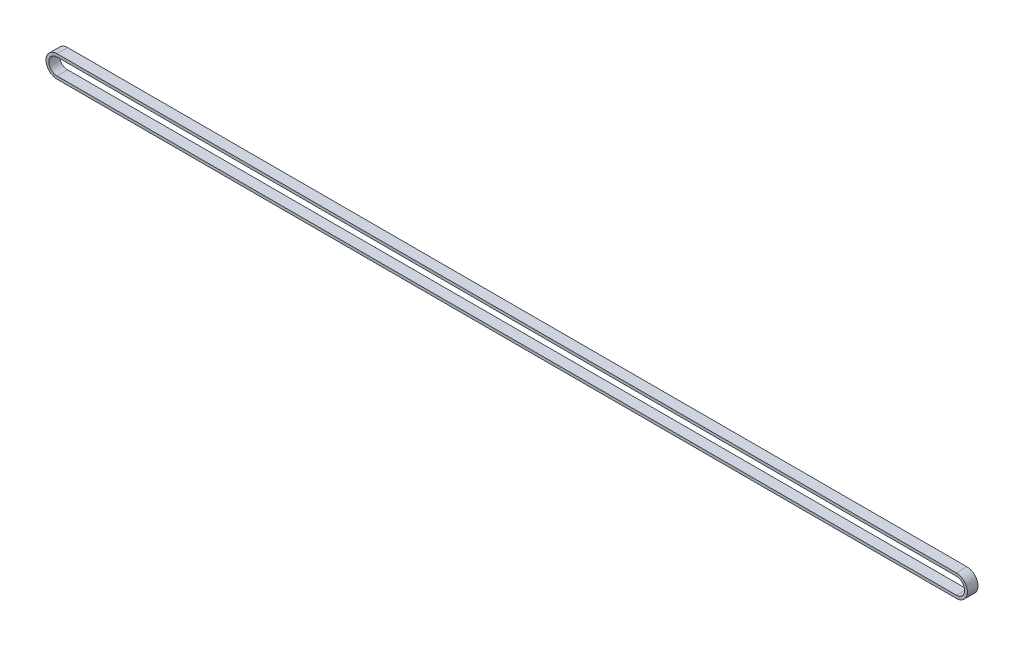
ISO-10303-21;
HEADER;
FILE_DESCRIPTION(('STEP AP214'),'2;1');
FILE_NAME('part.step','',(''),(''),'','','');
FILE_SCHEMA(('AUTOMOTIVE_DESIGN { 1 0 10303 214 1 1 1 1 }'));
ENDSEC;
DATA;
#1=APPLICATION_CONTEXT('core data for automotive mechanical design processes');
#2=APPLICATION_PROTOCOL_DEFINITION('international standard','automotive_design',2000,#1);
#3=PRODUCT_CONTEXT('',#1,'mechanical');
#4=PRODUCT('Part','Part','',(#3));
#5=PRODUCT_RELATED_PRODUCT_CATEGORY('part','',(#4));
#6=PRODUCT_DEFINITION_FORMATION('','',#4);
#7=PRODUCT_DEFINITION_CONTEXT('part definition',#1,'design');
#8=PRODUCT_DEFINITION('design','',#6,#7);
#9=PRODUCT_DEFINITION_SHAPE('','',#8);
#10=(LENGTH_UNIT() NAMED_UNIT(*) SI_UNIT(.MILLI.,.METRE.));
#11=(NAMED_UNIT(*) PLANE_ANGLE_UNIT() SI_UNIT($,.RADIAN.));
#12=(NAMED_UNIT(*) SI_UNIT($,.STERADIAN.) SOLID_ANGLE_UNIT());
#13=UNCERTAINTY_MEASURE_WITH_UNIT(LENGTH_MEASURE(1.E-05),#10,'distance_accuracy_value','');
#14=(GEOMETRIC_REPRESENTATION_CONTEXT(3) GLOBAL_UNCERTAINTY_ASSIGNED_CONTEXT((#13)) GLOBAL_UNIT_ASSIGNED_CONTEXT((#10,
#11,#12)) REPRESENTATION_CONTEXT('',''));
#15=CARTESIAN_POINT('',(0.,0.,0.));
#16=DIRECTION('',(0.,0.,1.));
#17=DIRECTION('',(1.,0.,0.));
#18=AXIS2_PLACEMENT_3D('',#15,#16,#17);
#19=CARTESIAN_POINT('',(528.475,0.,0.));
#20=DIRECTION('',(0.,0.,1.));
#21=DIRECTION('',(1.,0.,0.));
#22=AXIS2_PLACEMENT_3D('',#19,#20,#21);
#23=CYLINDRICAL_SURFACE('',#22,6.5);
#24=CARTESIAN_POINT('',(528.475,0.,6.25));
#25=DIRECTION('',(0.,0.,1.));
#26=DIRECTION('',(1.,0.,0.));
#27=AXIS2_PLACEMENT_3D('',#24,#25,#26);
#28=CIRCLE('',#27,6.5);
#29=CARTESIAN_POINT('',(528.475,-6.5,6.25));
#30=VERTEX_POINT('',#29);
#31=CARTESIAN_POINT('',(528.475,6.5,6.25));
#32=VERTEX_POINT('',#31);
#33=EDGE_CURVE('E131',#30,#32,#28,.T.);
#34=ORIENTED_EDGE('',*,*,#33,.F.);
#35=DIRECTION('',(0.,0.,1.));
#36=VECTOR('',#35,1.);
#37=CARTESIAN_POINT('',(528.475,-6.5,0.));
#38=LINE('',#37,#36);
#39=CARTESIAN_POINT('',(528.475,-6.5,0.));
#40=VERTEX_POINT('',#39);
#41=EDGE_CURVE('E11',#40,#30,#38,.T.);
#42=ORIENTED_EDGE('',*,*,#41,.F.);
#43=CARTESIAN_POINT('',(528.475,0.,0.));
#44=DIRECTION('',(0.,0.,1.));
#45=DIRECTION('',(1.,0.,0.));
#46=AXIS2_PLACEMENT_3D('',#43,#44,#45);
#47=CIRCLE('',#46,6.5);
#48=CARTESIAN_POINT('',(528.475,6.5,0.));
#49=VERTEX_POINT('',#48);
#50=EDGE_CURVE('E135',#40,#49,#47,.T.);
#51=ORIENTED_EDGE('',*,*,#50,.T.);
#52=DIRECTION('',(0.,0.,1.));
#53=VECTOR('',#52,1.);
#54=CARTESIAN_POINT('',(528.475,6.5,0.));
#55=LINE('',#54,#53);
#56=EDGE_CURVE('E36',#49,#32,#55,.T.);
#57=ORIENTED_EDGE('',*,*,#56,.T.);
#58=EDGE_LOOP('',(#34,#42,#51,#57));
#59=FACE_BOUND('',#58,.T.);
#60=ADVANCED_FACE('F33',(#59),#23,.T.);
#61=CARTESIAN_POINT('',(0.,-6.5,0.));
#62=DIRECTION('',(0.,-1.,0.));
#63=DIRECTION('',(0.,0.,-1.));
#64=AXIS2_PLACEMENT_3D('',#61,#62,#63);
#65=PLANE('',#64);
#66=DIRECTION('',(1.,0.,0.));
#67=VECTOR('',#66,1.);
#68=CARTESIAN_POINT('',(0.,-6.5,6.25));
#69=LINE('',#68,#67);
#70=CARTESIAN_POINT('',(0.,-6.5,6.25));
#71=VERTEX_POINT('',#70);
#72=EDGE_CURVE('E139',#71,#30,#69,.T.);
#73=ORIENTED_EDGE('',*,*,#72,.F.);
#74=DIRECTION('',(0.,0.,1.));
#75=VECTOR('',#74,1.);
#76=CARTESIAN_POINT('',(0.,-6.5,0.));
#77=LINE('',#76,#75);
#78=CARTESIAN_POINT('',(0.,-6.5,0.));
#79=VERTEX_POINT('',#78);
#80=EDGE_CURVE('E41',#79,#71,#77,.T.);
#81=ORIENTED_EDGE('',*,*,#80,.F.);
#82=DIRECTION('',(1.,0.,0.));
#83=VECTOR('',#82,1.);
#84=CARTESIAN_POINT('',(0.,-6.5,0.));
#85=LINE('',#84,#83);
#86=EDGE_CURVE('E145',#79,#40,#85,.T.);
#87=ORIENTED_EDGE('',*,*,#86,.T.);
#88=ORIENTED_EDGE('',*,*,#41,.T.);
#89=EDGE_LOOP('',(#73,#81,#87,#88));
#90=FACE_BOUND('',#89,.T.);
#91=ADVANCED_FACE('F171',(#90),#65,.T.);
#92=CARTESIAN_POINT('',(0.,0.,0.));
#93=DIRECTION('',(0.,0.,1.));
#94=DIRECTION('',(1.,0.,0.));
#95=AXIS2_PLACEMENT_3D('',#92,#93,#94);
#96=CYLINDRICAL_SURFACE('',#95,6.5);
#97=CARTESIAN_POINT('',(0.,0.,6.25));
#98=DIRECTION('',(0.,0.,1.));
#99=DIRECTION('',(1.,0.,0.));
#100=AXIS2_PLACEMENT_3D('',#97,#98,#99);
#101=CIRCLE('',#100,6.5);
#102=CARTESIAN_POINT('',(0.,6.5,6.25));
#103=VERTEX_POINT('',#102);
#104=EDGE_CURVE('E153',#103,#71,#101,.T.);
#105=ORIENTED_EDGE('',*,*,#104,.F.);
#106=DIRECTION('',(0.,0.,1.));
#107=VECTOR('',#106,1.);
#108=CARTESIAN_POINT('',(0.,6.5,0.));
#109=LINE('',#108,#107);
#110=CARTESIAN_POINT('',(0.,6.5,0.));
#111=VERTEX_POINT('',#110);
#112=EDGE_CURVE('E158',#111,#103,#109,.T.);
#113=ORIENTED_EDGE('',*,*,#112,.F.);
#114=CARTESIAN_POINT('',(0.,0.,0.));
#115=DIRECTION('',(0.,0.,1.));
#116=DIRECTION('',(1.,0.,0.));
#117=AXIS2_PLACEMENT_3D('',#114,#115,#116);
#118=CIRCLE('',#117,6.5);
#119=EDGE_CURVE('E142',#111,#79,#118,.T.);
#120=ORIENTED_EDGE('',*,*,#119,.T.);
#121=ORIENTED_EDGE('',*,*,#80,.T.);
#122=EDGE_LOOP('',(#105,#113,#120,#121));
#123=FACE_BOUND('',#122,.T.);
#124=ADVANCED_FACE('F175',(#123),#96,.T.);
#125=CARTESIAN_POINT('',(528.475,6.5,0.));
#126=DIRECTION('',(0.,1.,0.));
#127=DIRECTION('',(0.,0.,1.));
#128=AXIS2_PLACEMENT_3D('',#125,#126,#127);
#129=PLANE('',#128);
#130=DIRECTION('',(-1.,0.,0.));
#131=VECTOR('',#130,1.);
#132=CARTESIAN_POINT('',(528.475,6.5,6.25));
#133=LINE('',#132,#131);
#134=EDGE_CURVE('E150',#32,#103,#133,.T.);
#135=ORIENTED_EDGE('',*,*,#134,.F.);
#136=ORIENTED_EDGE('',*,*,#56,.F.);
#137=DIRECTION('',(-1.,0.,0.));
#138=VECTOR('',#137,1.);
#139=CARTESIAN_POINT('',(528.475,6.5,0.));
#140=LINE('',#139,#138);
#141=EDGE_CURVE('E138',#49,#111,#140,.T.);
#142=ORIENTED_EDGE('',*,*,#141,.T.);
#143=ORIENTED_EDGE('',*,*,#112,.T.);
#144=EDGE_LOOP('',(#135,#136,#142,#143));
#145=FACE_BOUND('',#144,.T.);
#146=ADVANCED_FACE('F166',(#145),#129,.T.);
#147=CARTESIAN_POINT('',(528.475,0.,0.));
#148=DIRECTION('',(0.,0.,1.));
#149=DIRECTION('',(1.,0.,0.));
#150=AXIS2_PLACEMENT_3D('',#147,#148,#149);
#151=PLANE('',#150);
#152=DIRECTION('',(-1.,0.,0.));
#153=VECTOR('',#152,1.);
#154=CARTESIAN_POINT('',(0.,4.848,0.));
#155=LINE('',#154,#153);
#156=CARTESIAN_POINT('',(528.475,4.84800000000001,0.));
#157=VERTEX_POINT('',#156);
#158=CARTESIAN_POINT('',(0.,4.848,0.));
#159=VERTEX_POINT('',#158);
#160=EDGE_CURVE('E106',#157,#159,#155,.T.);
#161=ORIENTED_EDGE('',*,*,#160,.T.);
#162=CARTESIAN_POINT('',(0.,0.,0.));
#163=DIRECTION('',(0.,0.,1.));
#164=DIRECTION('',(-1.,0.,0.));
#165=AXIS2_PLACEMENT_3D('',#162,#163,#164);
#166=CIRCLE('',#165,4.848);
#167=CARTESIAN_POINT('',(0.,-4.848,0.));
#168=VERTEX_POINT('',#167);
#169=EDGE_CURVE('E100',#159,#168,#166,.T.);
#170=ORIENTED_EDGE('',*,*,#169,.T.);
#171=DIRECTION('',(1.,0.,0.));
#172=VECTOR('',#171,1.);
#173=CARTESIAN_POINT('',(528.475,-4.848,0.));
#174=LINE('',#173,#172);
#175=CARTESIAN_POINT('',(528.475,-4.848,0.));
#176=VERTEX_POINT('',#175);
#177=EDGE_CURVE('E109',#168,#176,#174,.T.);
#178=ORIENTED_EDGE('',*,*,#177,.T.);
#179=CARTESIAN_POINT('',(528.475,0.,0.));
#180=DIRECTION('',(0.,0.,1.));
#181=DIRECTION('',(-1.,0.,0.));
#182=AXIS2_PLACEMENT_3D('',#179,#180,#181);
#183=CIRCLE('',#182,4.848);
#184=EDGE_CURVE('E49',#176,#157,#183,.T.);
#185=ORIENTED_EDGE('',*,*,#184,.T.);
#186=EDGE_LOOP('',(#161,#170,#178,#185));
#187=FACE_BOUND('',#186,.T.);
#188=ORIENTED_EDGE('',*,*,#50,.F.);
#189=ORIENTED_EDGE('',*,*,#86,.F.);
#190=ORIENTED_EDGE('',*,*,#119,.F.);
#191=ORIENTED_EDGE('',*,*,#141,.F.);
#192=EDGE_LOOP('',(#188,#189,#190,#191));
#193=FACE_BOUND('',#192,.T.);
#194=ADVANCED_FACE('F113',(#187,#193),#151,.F.);
#195=CARTESIAN_POINT('',(528.475,0.,6.25));
#196=DIRECTION('',(0.,0.,1.));
#197=DIRECTION('',(1.,0.,0.));
#198=AXIS2_PLACEMENT_3D('',#195,#196,#197);
#199=PLANE('',#198);
#200=CARTESIAN_POINT('',(0.,0.,6.25));
#201=DIRECTION('',(0.,0.,1.));
#202=DIRECTION('',(-1.,0.,0.));
#203=AXIS2_PLACEMENT_3D('',#200,#201,#202);
#204=CIRCLE('',#203,4.848);
#205=CARTESIAN_POINT('',(0.,4.848,6.25));
#206=VERTEX_POINT('',#205);
#207=CARTESIAN_POINT('',(0.,-4.848,6.25));
#208=VERTEX_POINT('',#207);
#209=EDGE_CURVE('E57',#206,#208,#204,.T.);
#210=ORIENTED_EDGE('',*,*,#209,.F.);
#211=DIRECTION('',(-1.,0.,0.));
#212=VECTOR('',#211,1.);
#213=CARTESIAN_POINT('',(0.,4.848,6.25));
#214=LINE('',#213,#212);
#215=CARTESIAN_POINT('',(528.475,4.84800000000001,6.25));
#216=VERTEX_POINT('',#215);
#217=EDGE_CURVE('E116',#216,#206,#214,.T.);
#218=ORIENTED_EDGE('',*,*,#217,.F.);
#219=CARTESIAN_POINT('',(528.475,0.,6.25));
#220=DIRECTION('',(0.,0.,1.));
#221=DIRECTION('',(-1.,0.,0.));
#222=AXIS2_PLACEMENT_3D('',#219,#220,#221);
#223=CIRCLE('',#222,4.848);
#224=CARTESIAN_POINT('',(528.475,-4.848,6.25));
#225=VERTEX_POINT('',#224);
#226=EDGE_CURVE('E119',#225,#216,#223,.T.);
#227=ORIENTED_EDGE('',*,*,#226,.F.);
#228=DIRECTION('',(1.,0.,0.));
#229=VECTOR('',#228,1.);
#230=CARTESIAN_POINT('',(528.475,-4.848,6.25));
#231=LINE('',#230,#229);
#232=EDGE_CURVE('E125',#208,#225,#231,.T.);
#233=ORIENTED_EDGE('',*,*,#232,.F.);
#234=EDGE_LOOP('',(#210,#218,#227,#233));
#235=FACE_BOUND('',#234,.T.);
#236=ORIENTED_EDGE('',*,*,#33,.T.);
#237=ORIENTED_EDGE('',*,*,#134,.T.);
#238=ORIENTED_EDGE('',*,*,#104,.T.);
#239=ORIENTED_EDGE('',*,*,#72,.T.);
#240=EDGE_LOOP('',(#236,#237,#238,#239));
#241=FACE_BOUND('',#240,.T.);
#242=ADVANCED_FACE('F168',(#235,#241),#199,.T.);
#243=CARTESIAN_POINT('',(0.,0.,0.));
#244=DIRECTION('',(0.,0.,1.));
#245=DIRECTION('',(1.,0.,0.));
#246=AXIS2_PLACEMENT_3D('',#243,#244,#245);
#247=CYLINDRICAL_SURFACE('',#246,4.848);
#248=ORIENTED_EDGE('',*,*,#209,.T.);
#249=DIRECTION('',(0.,0.,1.));
#250=VECTOR('',#249,1.);
#251=CARTESIAN_POINT('',(0.,-4.848,0.));
#252=LINE('',#251,#250);
#253=EDGE_CURVE('E96',#168,#208,#252,.T.);
#254=ORIENTED_EDGE('',*,*,#253,.F.);
#255=ORIENTED_EDGE('',*,*,#169,.F.);
#256=DIRECTION('',(0.,0.,1.));
#257=VECTOR('',#256,1.);
#258=CARTESIAN_POINT('',(0.,4.848,0.));
#259=LINE('',#258,#257);
#260=EDGE_CURVE('E129',#159,#206,#259,.T.);
#261=ORIENTED_EDGE('',*,*,#260,.T.);
#262=EDGE_LOOP('',(#248,#254,#255,#261));
#263=FACE_BOUND('',#262,.T.);
#264=ADVANCED_FACE('F98',(#263),#247,.F.);
#265=CARTESIAN_POINT('',(0.,4.848,0.));
#266=DIRECTION('',(0.,1.,0.));
#267=DIRECTION('',(0.,0.,1.));
#268=AXIS2_PLACEMENT_3D('',#265,#266,#267);
#269=PLANE('',#268);
#270=ORIENTED_EDGE('',*,*,#217,.T.);
#271=ORIENTED_EDGE('',*,*,#260,.F.);
#272=ORIENTED_EDGE('',*,*,#160,.F.);
#273=DIRECTION('',(0.,0.,1.));
#274=VECTOR('',#273,1.);
#275=CARTESIAN_POINT('',(528.475,4.84800000000001,0.));
#276=LINE('',#275,#274);
#277=EDGE_CURVE('E132',#157,#216,#276,.T.);
#278=ORIENTED_EDGE('',*,*,#277,.T.);
#279=EDGE_LOOP('',(#270,#271,#272,#278));
#280=FACE_BOUND('',#279,.T.);
#281=ADVANCED_FACE('F226',(#280),#269,.F.);
#282=CARTESIAN_POINT('',(528.475,0.,0.));
#283=DIRECTION('',(0.,0.,1.));
#284=DIRECTION('',(1.,0.,0.));
#285=AXIS2_PLACEMENT_3D('',#282,#283,#284);
#286=CYLINDRICAL_SURFACE('',#285,4.848);
#287=ORIENTED_EDGE('',*,*,#226,.T.);
#288=ORIENTED_EDGE('',*,*,#277,.F.);
#289=ORIENTED_EDGE('',*,*,#184,.F.);
#290=DIRECTION('',(0.,0.,1.));
#291=VECTOR('',#290,1.);
#292=CARTESIAN_POINT('',(528.475,-4.848,0.));
#293=LINE('',#292,#291);
#294=EDGE_CURVE('E105',#176,#225,#293,.T.);
#295=ORIENTED_EDGE('',*,*,#294,.T.);
#296=EDGE_LOOP('',(#287,#288,#289,#295));
#297=FACE_BOUND('',#296,.T.);
#298=ADVANCED_FACE('F235',(#297),#286,.F.);
#299=CARTESIAN_POINT('',(528.475,-4.848,0.));
#300=DIRECTION('',(0.,-1.,0.));
#301=DIRECTION('',(0.,0.,-1.));
#302=AXIS2_PLACEMENT_3D('',#299,#300,#301);
#303=PLANE('',#302);
#304=ORIENTED_EDGE('',*,*,#232,.T.);
#305=ORIENTED_EDGE('',*,*,#294,.F.);
#306=ORIENTED_EDGE('',*,*,#177,.F.);
#307=ORIENTED_EDGE('',*,*,#253,.T.);
#308=EDGE_LOOP('',(#304,#305,#306,#307));
#309=FACE_BOUND('',#308,.T.);
#310=ADVANCED_FACE('F110',(#309),#303,.F.);
#311=CLOSED_SHELL('',(#60,#91,#124,#146,#194,#242,#264,#281,#298,#310));
#312=MANIFOLD_SOLID_BREP('B2',#311);
#313=ADVANCED_BREP_SHAPE_REPRESENTATION('',(#18,#312),#14);
#314=SHAPE_DEFINITION_REPRESENTATION(#9,#313);
ENDSEC;
END-ISO-10303-21;
